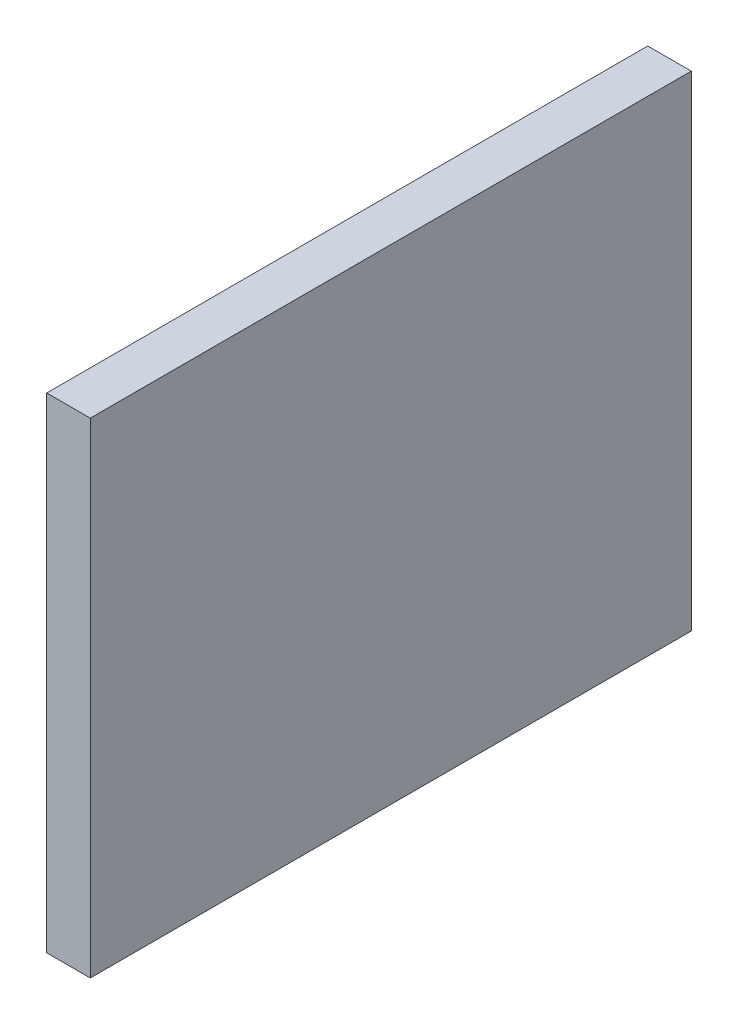
ISO-10303-21;
HEADER;
FILE_DESCRIPTION(('STEP AP214'),'2;1');
FILE_NAME('part.step','',(''),(''),'','','');
FILE_SCHEMA(('AUTOMOTIVE_DESIGN { 1 0 10303 214 1 1 1 1 }'));
ENDSEC;
DATA;
#1=APPLICATION_CONTEXT('core data for automotive mechanical design processes');
#2=APPLICATION_PROTOCOL_DEFINITION('international standard','automotive_design',2000,#1);
#3=PRODUCT_CONTEXT('',#1,'mechanical');
#4=PRODUCT('Part','Part','',(#3));
#5=PRODUCT_RELATED_PRODUCT_CATEGORY('part','',(#4));
#6=PRODUCT_DEFINITION_FORMATION('','',#4);
#7=PRODUCT_DEFINITION_CONTEXT('part definition',#1,'design');
#8=PRODUCT_DEFINITION('design','',#6,#7);
#9=PRODUCT_DEFINITION_SHAPE('','',#8);
#10=(LENGTH_UNIT() NAMED_UNIT(*) SI_UNIT(.MILLI.,.METRE.));
#11=(NAMED_UNIT(*) PLANE_ANGLE_UNIT() SI_UNIT($,.RADIAN.));
#12=(NAMED_UNIT(*) SI_UNIT($,.STERADIAN.) SOLID_ANGLE_UNIT());
#13=UNCERTAINTY_MEASURE_WITH_UNIT(LENGTH_MEASURE(1.E-05),#10,'distance_accuracy_value','');
#14=(GEOMETRIC_REPRESENTATION_CONTEXT(3) GLOBAL_UNCERTAINTY_ASSIGNED_CONTEXT((#13)) GLOBAL_UNIT_ASSIGNED_CONTEXT((#10,
#11,#12)) REPRESENTATION_CONTEXT('',''));
#15=CARTESIAN_POINT('',(0.,0.,0.));
#16=DIRECTION('',(0.,0.,1.));
#17=DIRECTION('',(1.,0.,0.));
#18=AXIS2_PLACEMENT_3D('',#15,#16,#17);
#19=CARTESIAN_POINT('',(3.,2.116270196653,17.3855159532182));
#20=DIRECTION('',(0.,0.,-1.));
#21=DIRECTION('',(-1.,0.,0.));
#22=AXIS2_PLACEMENT_3D('',#19,#20,#21);
#23=PLANE('',#22);
#24=DIRECTION('',(0.,-1.,0.));
#25=VECTOR('',#24,1.);
#26=CARTESIAN_POINT('',(0.,2.116270196653,17.3855159532182));
#27=LINE('',#26,#25);
#28=CARTESIAN_POINT('',(0.,2.116270196653,17.3855159532182));
#29=VERTEX_POINT('',#28);
#30=CARTESIAN_POINT('',(0.,-31.2837298083322,17.3855159532182));
#31=VERTEX_POINT('',#30);
#32=EDGE_CURVE('E96',#29,#31,#27,.T.);
#33=ORIENTED_EDGE('',*,*,#32,.T.);
#34=DIRECTION('',(-1.,0.,0.));
#35=VECTOR('',#34,1.);
#36=CARTESIAN_POINT('',(3.,-31.2837298083322,17.3855159532182));
#37=LINE('',#36,#35);
#38=CARTESIAN_POINT('',(3.,-31.2837298083322,17.3855159532182));
#39=VERTEX_POINT('',#38);
#40=EDGE_CURVE('E11',#39,#31,#37,.T.);
#41=ORIENTED_EDGE('',*,*,#40,.F.);
#42=DIRECTION('',(0.,-1.,0.));
#43=VECTOR('',#42,1.);
#44=CARTESIAN_POINT('',(3.,2.116270196653,17.3855159532182));
#45=LINE('',#44,#43);
#46=CARTESIAN_POINT('',(3.,2.116270196653,17.3855159532182));
#47=VERTEX_POINT('',#46);
#48=EDGE_CURVE('E84',#47,#39,#45,.T.);
#49=ORIENTED_EDGE('',*,*,#48,.F.);
#50=DIRECTION('',(-1.,0.,0.));
#51=VECTOR('',#50,1.);
#52=CARTESIAN_POINT('',(3.,2.116270196653,17.3855159532182));
#53=LINE('',#52,#51);
#54=EDGE_CURVE('E92',#47,#29,#53,.T.);
#55=ORIENTED_EDGE('',*,*,#54,.T.);
#56=EDGE_LOOP('',(#33,#41,#49,#55));
#57=FACE_BOUND('',#56,.T.);
#58=ADVANCED_FACE('F33',(#57),#23,.F.);
#59=CARTESIAN_POINT('',(3.,-31.2837298083322,17.3855159532182));
#60=DIRECTION('',(0.,1.,0.));
#61=DIRECTION('',(0.,0.,1.));
#62=AXIS2_PLACEMENT_3D('',#59,#60,#61);
#63=PLANE('',#62);
#64=DIRECTION('',(0.,0.,-1.));
#65=VECTOR('',#64,1.);
#66=CARTESIAN_POINT('',(0.,-31.2837298083322,17.3855159532182));
#67=LINE('',#66,#65);
#68=CARTESIAN_POINT('',(0.,-31.2837298083322,-24.0144840467817));
#69=VERTEX_POINT('',#68);
#70=EDGE_CURVE('E88',#31,#69,#67,.T.);
#71=ORIENTED_EDGE('',*,*,#70,.T.);
#72=DIRECTION('',(-1.,0.,0.));
#73=VECTOR('',#72,1.);
#74=CARTESIAN_POINT('',(3.,-31.2837298083322,-24.0144840467817));
#75=LINE('',#74,#73);
#76=CARTESIAN_POINT('',(3.,-31.2837298083322,-24.0144840467817));
#77=VERTEX_POINT('',#76);
#78=EDGE_CURVE('E41',#77,#69,#75,.T.);
#79=ORIENTED_EDGE('',*,*,#78,.F.);
#80=DIRECTION('',(0.,0.,-1.));
#81=VECTOR('',#80,1.);
#82=CARTESIAN_POINT('',(3.,-31.2837298083322,17.3855159532182));
#83=LINE('',#82,#81);
#84=EDGE_CURVE('E79',#39,#77,#83,.T.);
#85=ORIENTED_EDGE('',*,*,#84,.F.);
#86=ORIENTED_EDGE('',*,*,#40,.T.);
#87=EDGE_LOOP('',(#71,#79,#85,#86));
#88=FACE_BOUND('',#87,.T.);
#89=ADVANCED_FACE('F87',(#88),#63,.F.);
#90=CARTESIAN_POINT('',(3.,-31.2837298083322,-24.0144840467817));
#91=DIRECTION('',(0.,0.,1.));
#92=DIRECTION('',(1.,0.,0.));
#93=AXIS2_PLACEMENT_3D('',#90,#91,#92);
#94=PLANE('',#93);
#95=DIRECTION('',(0.,1.,0.));
#96=VECTOR('',#95,1.);
#97=CARTESIAN_POINT('',(0.,-31.2837298083322,-24.0144840467817));
#98=LINE('',#97,#96);
#99=CARTESIAN_POINT('',(0.,2.116270196653,-24.0144840467817));
#100=VERTEX_POINT('',#99);
#101=EDGE_CURVE('E66',#69,#100,#98,.T.);
#102=ORIENTED_EDGE('',*,*,#101,.T.);
#103=DIRECTION('',(-1.,0.,0.));
#104=VECTOR('',#103,1.);
#105=CARTESIAN_POINT('',(3.,2.116270196653,-24.0144840467817));
#106=LINE('',#105,#104);
#107=CARTESIAN_POINT('',(3.,2.116270196653,-24.0144840467817));
#108=VERTEX_POINT('',#107);
#109=EDGE_CURVE('E89',#108,#100,#106,.T.);
#110=ORIENTED_EDGE('',*,*,#109,.F.);
#111=DIRECTION('',(0.,1.,0.));
#112=VECTOR('',#111,1.);
#113=CARTESIAN_POINT('',(3.,-31.2837298083322,-24.0144840467817));
#114=LINE('',#113,#112);
#115=EDGE_CURVE('E82',#77,#108,#114,.T.);
#116=ORIENTED_EDGE('',*,*,#115,.F.);
#117=ORIENTED_EDGE('',*,*,#78,.T.);
#118=EDGE_LOOP('',(#102,#110,#116,#117));
#119=FACE_BOUND('',#118,.T.);
#120=ADVANCED_FACE('F90',(#119),#94,.F.);
#121=CARTESIAN_POINT('',(3.,2.116270196653,-24.0144840467817));
#122=DIRECTION('',(0.,-1.,0.));
#123=DIRECTION('',(0.,0.,-1.));
#124=AXIS2_PLACEMENT_3D('',#121,#122,#123);
#125=PLANE('',#124);
#126=DIRECTION('',(0.,0.,1.));
#127=VECTOR('',#126,1.);
#128=CARTESIAN_POINT('',(0.,2.116270196653,-24.0144840467817));
#129=LINE('',#128,#127);
#130=EDGE_CURVE('E72',#100,#29,#129,.T.);
#131=ORIENTED_EDGE('',*,*,#130,.T.);
#132=ORIENTED_EDGE('',*,*,#54,.F.);
#133=DIRECTION('',(0.,0.,1.));
#134=VECTOR('',#133,1.);
#135=CARTESIAN_POINT('',(3.,2.116270196653,-24.0144840467817));
#136=LINE('',#135,#134);
#137=EDGE_CURVE('E49',#108,#47,#136,.T.);
#138=ORIENTED_EDGE('',*,*,#137,.F.);
#139=ORIENTED_EDGE('',*,*,#109,.T.);
#140=EDGE_LOOP('',(#131,#132,#138,#139));
#141=FACE_BOUND('',#140,.T.);
#142=ADVANCED_FACE('F103',(#141),#125,.F.);
#143=CARTESIAN_POINT('',(3.,0.,0.));
#144=DIRECTION('',(1.,0.,0.));
#145=DIRECTION('',(0.,0.,-1.));
#146=AXIS2_PLACEMENT_3D('',#143,#144,#145);
#147=PLANE('',#146);
#148=ORIENTED_EDGE('',*,*,#48,.T.);
#149=ORIENTED_EDGE('',*,*,#84,.T.);
#150=ORIENTED_EDGE('',*,*,#115,.T.);
#151=ORIENTED_EDGE('',*,*,#137,.T.);
#152=EDGE_LOOP('',(#148,#149,#150,#151));
#153=FACE_BOUND('',#152,.T.);
#154=ADVANCED_FACE('F80',(#153),#147,.T.);
#155=CARTESIAN_POINT('',(0.,0.,0.));
#156=DIRECTION('',(1.,0.,0.));
#157=DIRECTION('',(0.,0.,-1.));
#158=AXIS2_PLACEMENT_3D('',#155,#156,#157);
#159=PLANE('',#158);
#160=ORIENTED_EDGE('',*,*,#32,.F.);
#161=ORIENTED_EDGE('',*,*,#130,.F.);
#162=ORIENTED_EDGE('',*,*,#101,.F.);
#163=ORIENTED_EDGE('',*,*,#70,.F.);
#164=EDGE_LOOP('',(#160,#161,#162,#163));
#165=FACE_BOUND('',#164,.T.);
#166=ADVANCED_FACE('F106',(#165),#159,.F.);
#167=CLOSED_SHELL('',(#58,#89,#120,#142,#154,#166));
#168=MANIFOLD_SOLID_BREP('B2',#167);
#169=ADVANCED_BREP_SHAPE_REPRESENTATION('',(#18,#168),#14);
#170=SHAPE_DEFINITION_REPRESENTATION(#9,#169);
ENDSEC;
END-ISO-10303-21;
